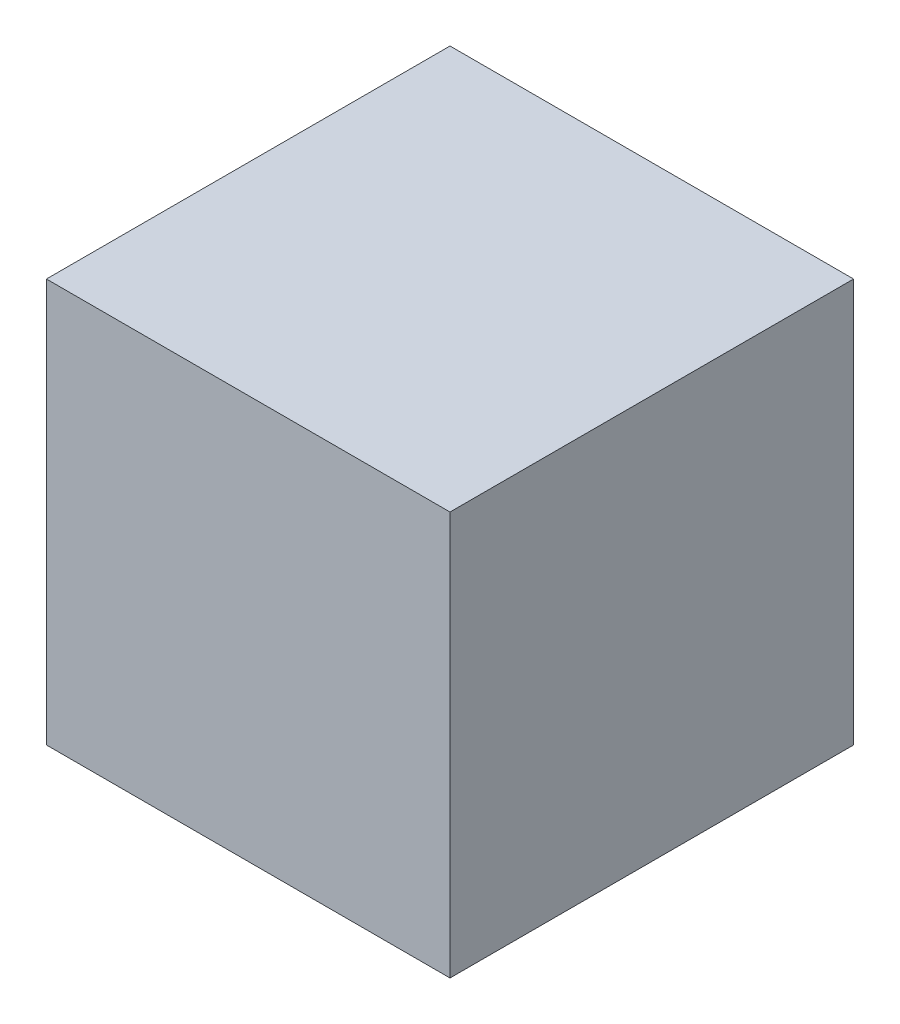
ISO-10303-21;
HEADER;
FILE_DESCRIPTION(('STEP AP214'),'2;1');
FILE_NAME('part.step','',(''),(''),'','','');
FILE_SCHEMA(('AUTOMOTIVE_DESIGN { 1 0 10303 214 1 1 1 1 }'));
ENDSEC;
DATA;
#1=APPLICATION_CONTEXT('core data for automotive mechanical design processes');
#2=APPLICATION_PROTOCOL_DEFINITION('international standard','automotive_design',2000,#1);
#3=PRODUCT_CONTEXT('',#1,'mechanical');
#4=PRODUCT('Part','Part','',(#3));
#5=PRODUCT_RELATED_PRODUCT_CATEGORY('part','',(#4));
#6=PRODUCT_DEFINITION_FORMATION('','',#4);
#7=PRODUCT_DEFINITION_CONTEXT('part definition',#1,'design');
#8=PRODUCT_DEFINITION('design','',#6,#7);
#9=PRODUCT_DEFINITION_SHAPE('','',#8);
#10=(LENGTH_UNIT() NAMED_UNIT(*) SI_UNIT(.MILLI.,.METRE.));
#11=(NAMED_UNIT(*) PLANE_ANGLE_UNIT() SI_UNIT($,.RADIAN.));
#12=(NAMED_UNIT(*) SI_UNIT($,.STERADIAN.) SOLID_ANGLE_UNIT());
#13=UNCERTAINTY_MEASURE_WITH_UNIT(LENGTH_MEASURE(1.E-05),#10,'distance_accuracy_value','');
#14=(GEOMETRIC_REPRESENTATION_CONTEXT(3) GLOBAL_UNCERTAINTY_ASSIGNED_CONTEXT((#13)) GLOBAL_UNIT_ASSIGNED_CONTEXT((#10,
#11,#12)) REPRESENTATION_CONTEXT('',''));
#15=CARTESIAN_POINT('',(0.,0.,0.));
#16=DIRECTION('',(0.,0.,1.));
#17=DIRECTION('',(1.,0.,0.));
#18=AXIS2_PLACEMENT_3D('',#15,#16,#17);
#19=CARTESIAN_POINT('',(300.,-300.,600.));
#20=DIRECTION('',(-1.,0.,0.));
#21=DIRECTION('',(0.,0.,1.));
#22=AXIS2_PLACEMENT_3D('',#19,#20,#21);
#23=PLANE('',#22);
#24=DIRECTION('',(0.,1.,0.));
#25=VECTOR('',#24,1.);
#26=CARTESIAN_POINT('',(300.,-300.,0.));
#27=LINE('',#26,#25);
#28=CARTESIAN_POINT('',(300.,-300.,0.));
#29=VERTEX_POINT('',#28);
#30=CARTESIAN_POINT('',(300.,300.,0.));
#31=VERTEX_POINT('',#30);
#32=EDGE_CURVE('E98',#29,#31,#27,.T.);
#33=ORIENTED_EDGE('',*,*,#32,.T.);
#34=DIRECTION('',(0.,0.,-1.));
#35=VECTOR('',#34,1.);
#36=CARTESIAN_POINT('',(300.,300.,600.));
#37=LINE('',#36,#35);
#38=CARTESIAN_POINT('',(300.,300.,600.));
#39=VERTEX_POINT('',#38);
#40=EDGE_CURVE('E11',#39,#31,#37,.T.);
#41=ORIENTED_EDGE('',*,*,#40,.F.);
#42=DIRECTION('',(0.,1.,0.));
#43=VECTOR('',#42,1.);
#44=CARTESIAN_POINT('',(300.,-300.,600.));
#45=LINE('',#44,#43);
#46=CARTESIAN_POINT('',(300.,-300.,600.));
#47=VERTEX_POINT('',#46);
#48=EDGE_CURVE('E86',#47,#39,#45,.T.);
#49=ORIENTED_EDGE('',*,*,#48,.F.);
#50=DIRECTION('',(0.,0.,-1.));
#51=VECTOR('',#50,1.);
#52=CARTESIAN_POINT('',(300.,-300.,600.));
#53=LINE('',#52,#51);
#54=EDGE_CURVE('E94',#47,#29,#53,.T.);
#55=ORIENTED_EDGE('',*,*,#54,.T.);
#56=EDGE_LOOP('',(#33,#41,#49,#55));
#57=FACE_BOUND('',#56,.T.);
#58=ADVANCED_FACE('F35',(#57),#23,.F.);
#59=CARTESIAN_POINT('',(-300.,300.,600.));
#60=DIRECTION('',(0.,-1.,0.));
#61=DIRECTION('',(0.,0.,-1.));
#62=AXIS2_PLACEMENT_3D('',#59,#60,#61);
#63=PLANE('',#62);
#64=DIRECTION('',(-1.,0.,0.));
#65=VECTOR('',#64,1.);
#66=CARTESIAN_POINT('',(-300.,300.,0.));
#67=LINE('',#66,#65);
#68=CARTESIAN_POINT('',(-300.,300.,0.));
#69=VERTEX_POINT('',#68);
#70=EDGE_CURVE('E90',#31,#69,#67,.T.);
#71=ORIENTED_EDGE('',*,*,#70,.T.);
#72=DIRECTION('',(0.,0.,-1.));
#73=VECTOR('',#72,1.);
#74=CARTESIAN_POINT('',(-300.,300.,600.));
#75=LINE('',#74,#73);
#76=CARTESIAN_POINT('',(-300.,300.,600.));
#77=VERTEX_POINT('',#76);
#78=EDGE_CURVE('E43',#77,#69,#75,.T.);
#79=ORIENTED_EDGE('',*,*,#78,.F.);
#80=DIRECTION('',(-1.,0.,0.));
#81=VECTOR('',#80,1.);
#82=CARTESIAN_POINT('',(-300.,300.,600.));
#83=LINE('',#82,#81);
#84=EDGE_CURVE('E81',#39,#77,#83,.T.);
#85=ORIENTED_EDGE('',*,*,#84,.F.);
#86=ORIENTED_EDGE('',*,*,#40,.T.);
#87=EDGE_LOOP('',(#71,#79,#85,#86));
#88=FACE_BOUND('',#87,.T.);
#89=ADVANCED_FACE('F89',(#88),#63,.F.);
#90=CARTESIAN_POINT('',(-300.,-300.,600.));
#91=DIRECTION('',(1.,0.,0.));
#92=DIRECTION('',(0.,0.,-1.));
#93=AXIS2_PLACEMENT_3D('',#90,#91,#92);
#94=PLANE('',#93);
#95=DIRECTION('',(0.,-1.,0.));
#96=VECTOR('',#95,1.);
#97=CARTESIAN_POINT('',(-300.,-300.,0.));
#98=LINE('',#97,#96);
#99=CARTESIAN_POINT('',(-300.,-300.,0.));
#100=VERTEX_POINT('',#99);
#101=EDGE_CURVE('E68',#69,#100,#98,.T.);
#102=ORIENTED_EDGE('',*,*,#101,.T.);
#103=DIRECTION('',(0.,0.,-1.));
#104=VECTOR('',#103,1.);
#105=CARTESIAN_POINT('',(-300.,-300.,600.));
#106=LINE('',#105,#104);
#107=CARTESIAN_POINT('',(-300.,-300.,600.));
#108=VERTEX_POINT('',#107);
#109=EDGE_CURVE('E91',#108,#100,#106,.T.);
#110=ORIENTED_EDGE('',*,*,#109,.F.);
#111=DIRECTION('',(0.,-1.,0.));
#112=VECTOR('',#111,1.);
#113=CARTESIAN_POINT('',(-300.,-300.,600.));
#114=LINE('',#113,#112);
#115=EDGE_CURVE('E84',#77,#108,#114,.T.);
#116=ORIENTED_EDGE('',*,*,#115,.F.);
#117=ORIENTED_EDGE('',*,*,#78,.T.);
#118=EDGE_LOOP('',(#102,#110,#116,#117));
#119=FACE_BOUND('',#118,.T.);
#120=ADVANCED_FACE('F92',(#119),#94,.F.);
#121=CARTESIAN_POINT('',(-300.,-300.,600.));
#122=DIRECTION('',(0.,1.,0.));
#123=DIRECTION('',(0.,0.,1.));
#124=AXIS2_PLACEMENT_3D('',#121,#122,#123);
#125=PLANE('',#124);
#126=DIRECTION('',(1.,0.,0.));
#127=VECTOR('',#126,1.);
#128=CARTESIAN_POINT('',(-300.,-300.,0.));
#129=LINE('',#128,#127);
#130=EDGE_CURVE('E74',#100,#29,#129,.T.);
#131=ORIENTED_EDGE('',*,*,#130,.T.);
#132=ORIENTED_EDGE('',*,*,#54,.F.);
#133=DIRECTION('',(1.,0.,0.));
#134=VECTOR('',#133,1.);
#135=CARTESIAN_POINT('',(-300.,-300.,600.));
#136=LINE('',#135,#134);
#137=EDGE_CURVE('E51',#108,#47,#136,.T.);
#138=ORIENTED_EDGE('',*,*,#137,.F.);
#139=ORIENTED_EDGE('',*,*,#109,.T.);
#140=EDGE_LOOP('',(#131,#132,#138,#139));
#141=FACE_BOUND('',#140,.T.);
#142=ADVANCED_FACE('F105',(#141),#125,.F.);
#143=CARTESIAN_POINT('',(0.,0.,600.));
#144=DIRECTION('',(0.,0.,-1.));
#145=DIRECTION('',(-1.,0.,0.));
#146=AXIS2_PLACEMENT_3D('',#143,#144,#145);
#147=PLANE('',#146);
#148=ORIENTED_EDGE('',*,*,#48,.T.);
#149=ORIENTED_EDGE('',*,*,#84,.T.);
#150=ORIENTED_EDGE('',*,*,#115,.T.);
#151=ORIENTED_EDGE('',*,*,#137,.T.);
#152=EDGE_LOOP('',(#148,#149,#150,#151));
#153=FACE_BOUND('',#152,.T.);
#154=ADVANCED_FACE('F82',(#153),#147,.F.);
#155=CARTESIAN_POINT('',(0.,0.,0.));
#156=DIRECTION('',(0.,0.,-1.));
#157=DIRECTION('',(-1.,0.,0.));
#158=AXIS2_PLACEMENT_3D('',#155,#156,#157);
#159=PLANE('',#158);
#160=ORIENTED_EDGE('',*,*,#32,.F.);
#161=ORIENTED_EDGE('',*,*,#130,.F.);
#162=ORIENTED_EDGE('',*,*,#101,.F.);
#163=ORIENTED_EDGE('',*,*,#70,.F.);
#164=EDGE_LOOP('',(#160,#161,#162,#163));
#165=FACE_BOUND('',#164,.T.);
#166=ADVANCED_FACE('F108',(#165),#159,.T.);
#167=CLOSED_SHELL('',(#58,#89,#120,#142,#154,#166));
#168=MANIFOLD_SOLID_BREP('B2',#167);
#169=ADVANCED_BREP_SHAPE_REPRESENTATION('',(#18,#168),#14);
#170=SHAPE_DEFINITION_REPRESENTATION(#9,#169);
ENDSEC;
END-ISO-10303-21;
